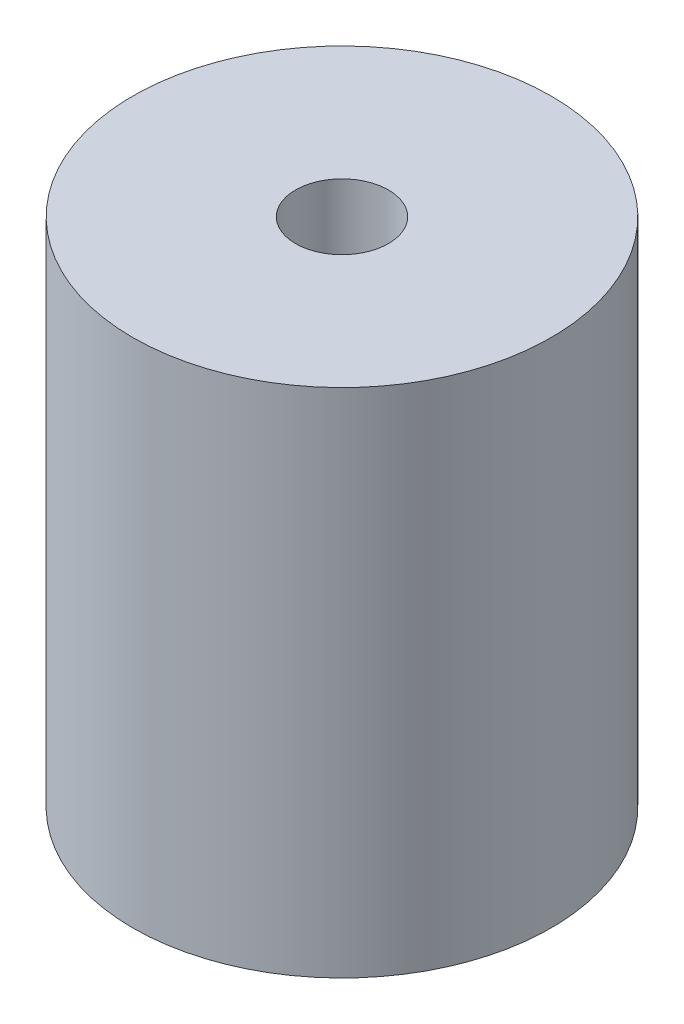
ISO-10303-21;
HEADER;
FILE_DESCRIPTION(('STEP AP214'),'2;1');
FILE_NAME('part.step','',(''),(''),'','','');
FILE_SCHEMA(('AUTOMOTIVE_DESIGN { 1 0 10303 214 1 1 1 1 }'));
ENDSEC;
DATA;
#1=APPLICATION_CONTEXT('core data for automotive mechanical design processes');
#2=APPLICATION_PROTOCOL_DEFINITION('international standard','automotive_design',2000,#1);
#3=PRODUCT_CONTEXT('',#1,'mechanical');
#4=PRODUCT('Part','Part','',(#3));
#5=PRODUCT_RELATED_PRODUCT_CATEGORY('part','',(#4));
#6=PRODUCT_DEFINITION_FORMATION('','',#4);
#7=PRODUCT_DEFINITION_CONTEXT('part definition',#1,'design');
#8=PRODUCT_DEFINITION('design','',#6,#7);
#9=PRODUCT_DEFINITION_SHAPE('','',#8);
#10=(LENGTH_UNIT() NAMED_UNIT(*) SI_UNIT(.MILLI.,.METRE.));
#11=(NAMED_UNIT(*) PLANE_ANGLE_UNIT() SI_UNIT($,.RADIAN.));
#12=(NAMED_UNIT(*) SI_UNIT($,.STERADIAN.) SOLID_ANGLE_UNIT());
#13=UNCERTAINTY_MEASURE_WITH_UNIT(LENGTH_MEASURE(1.E-05),#10,'distance_accuracy_value','');
#14=(GEOMETRIC_REPRESENTATION_CONTEXT(3) GLOBAL_UNCERTAINTY_ASSIGNED_CONTEXT((#13)) GLOBAL_UNIT_ASSIGNED_CONTEXT((#10,
#11,#12)) REPRESENTATION_CONTEXT('',''));
#15=CARTESIAN_POINT('',(0.,0.,0.));
#16=DIRECTION('',(0.,0.,1.));
#17=DIRECTION('',(1.,0.,0.));
#18=AXIS2_PLACEMENT_3D('',#15,#16,#17);
#19=CARTESIAN_POINT('',(0.,55.,0.));
#20=DIRECTION('',(0.,-1.,0.));
#21=DIRECTION('',(0.,0.,-1.));
#22=AXIS2_PLACEMENT_3D('',#19,#20,#21);
#23=CYLINDRICAL_SURFACE('',#22,22.5);
#24=CARTESIAN_POINT('',(0.,55.,0.));
#25=DIRECTION('',(0.,1.,0.));
#26=DIRECTION('',(0.,0.,1.));
#27=AXIS2_PLACEMENT_3D('',#24,#25,#26);
#28=CIRCLE('',#27,22.5);
#29=CARTESIAN_POINT('',(0.,55.,22.5));
#30=VERTEX_POINT('',#29);
#31=EDGE_CURVE('E10',#30,#30,#28,.T.);
#32=ORIENTED_EDGE('',*,*,#31,.F.);
#33=EDGE_LOOP('',(#32));
#34=FACE_BOUND('',#33,.T.);
#35=CARTESIAN_POINT('',(0.,0.,0.));
#36=DIRECTION('',(0.,1.,0.));
#37=DIRECTION('',(0.,0.,1.));
#38=AXIS2_PLACEMENT_3D('',#35,#36,#37);
#39=CIRCLE('',#38,22.5);
#40=CARTESIAN_POINT('',(0.,0.,22.5));
#41=VERTEX_POINT('',#40);
#42=EDGE_CURVE('E38',#41,#41,#39,.T.);
#43=ORIENTED_EDGE('',*,*,#42,.T.);
#44=EDGE_LOOP('',(#43));
#45=FACE_BOUND('',#44,.T.);
#46=ADVANCED_FACE('F35',(#34,#45),#23,.T.);
#47=CARTESIAN_POINT('',(0.,55.,0.));
#48=DIRECTION('',(0.,1.,0.));
#49=DIRECTION('',(0.,0.,1.));
#50=AXIS2_PLACEMENT_3D('',#47,#48,#49);
#51=PLANE('',#50);
#52=CARTESIAN_POINT('',(0.,55.,0.));
#53=DIRECTION('',(0.,1.,0.));
#54=DIRECTION('',(0.,0.,1.));
#55=AXIS2_PLACEMENT_3D('',#52,#53,#54);
#56=CIRCLE('',#55,5.);
#57=CARTESIAN_POINT('',(0.,55.,5.));
#58=VERTEX_POINT('',#57);
#59=EDGE_CURVE('E47',#58,#58,#56,.T.);
#60=ORIENTED_EDGE('',*,*,#59,.F.);
#61=EDGE_LOOP('',(#60));
#62=FACE_BOUND('',#61,.T.);
#63=ORIENTED_EDGE('',*,*,#31,.T.);
#64=EDGE_LOOP('',(#63));
#65=FACE_BOUND('',#64,.T.);
#66=ADVANCED_FACE('F72',(#62,#65),#51,.T.);
#67=CARTESIAN_POINT('',(0.,0.,0.));
#68=DIRECTION('',(0.,1.,0.));
#69=DIRECTION('',(0.,0.,1.));
#70=AXIS2_PLACEMENT_3D('',#67,#68,#69);
#71=PLANE('',#70);
#72=CARTESIAN_POINT('',(0.,0.,0.));
#73=DIRECTION('',(0.,-1.,0.));
#74=DIRECTION('',(0.,0.,-1.));
#75=AXIS2_PLACEMENT_3D('',#72,#73,#74);
#76=CIRCLE('',#75,5.);
#77=CARTESIAN_POINT('',(0.,0.,-5.));
#78=VERTEX_POINT('',#77);
#79=EDGE_CURVE('E53',#78,#78,#76,.T.);
#80=ORIENTED_EDGE('',*,*,#79,.F.);
#81=EDGE_LOOP('',(#80));
#82=FACE_BOUND('',#81,.T.);
#83=ORIENTED_EDGE('',*,*,#42,.F.);
#84=EDGE_LOOP('',(#83));
#85=FACE_BOUND('',#84,.T.);
#86=ADVANCED_FACE('F68',(#82,#85),#71,.F.);
#87=CARTESIAN_POINT('',(0.,45.,0.));
#88=DIRECTION('',(0.,1.,0.));
#89=DIRECTION('',(0.,0.,1.));
#90=AXIS2_PLACEMENT_3D('',#87,#88,#89);
#91=CYLINDRICAL_SURFACE('',#90,5.);
#92=CARTESIAN_POINT('',(0.,45.,0.));
#93=DIRECTION('',(0.,1.,0.));
#94=DIRECTION('',(0.,0.,1.));
#95=AXIS2_PLACEMENT_3D('',#92,#93,#94);
#96=CIRCLE('',#95,5.);
#97=CARTESIAN_POINT('',(0.,45.,5.));
#98=VERTEX_POINT('',#97);
#99=EDGE_CURVE('E45',#98,#98,#96,.T.);
#100=ORIENTED_EDGE('',*,*,#99,.F.);
#101=EDGE_LOOP('',(#100));
#102=FACE_BOUND('',#101,.T.);
#103=ORIENTED_EDGE('',*,*,#59,.T.);
#104=EDGE_LOOP('',(#103));
#105=FACE_BOUND('',#104,.T.);
#106=ADVANCED_FACE('F71',(#102,#105),#91,.F.);
#107=CARTESIAN_POINT('',(0.,45.,0.));
#108=DIRECTION('',(0.,1.,0.));
#109=DIRECTION('',(0.,0.,1.));
#110=AXIS2_PLACEMENT_3D('',#107,#108,#109);
#111=PLANE('',#110);
#112=ORIENTED_EDGE('',*,*,#99,.T.);
#113=EDGE_LOOP('',(#112));
#114=FACE_BOUND('',#113,.T.);
#115=ADVANCED_FACE('F64',(#114),#111,.T.);
#116=CARTESIAN_POINT('',(0.,10.,0.));
#117=DIRECTION('',(0.,-1.,0.));
#118=DIRECTION('',(0.,0.,-1.));
#119=AXIS2_PLACEMENT_3D('',#116,#117,#118);
#120=CYLINDRICAL_SURFACE('',#119,5.);
#121=CARTESIAN_POINT('',(0.,10.,0.));
#122=DIRECTION('',(0.,-1.,0.));
#123=DIRECTION('',(0.,0.,-1.));
#124=AXIS2_PLACEMENT_3D('',#121,#122,#123);
#125=CIRCLE('',#124,5.);
#126=CARTESIAN_POINT('',(0.,10.,-5.));
#127=VERTEX_POINT('',#126);
#128=EDGE_CURVE('E50',#127,#127,#125,.T.);
#129=ORIENTED_EDGE('',*,*,#128,.F.);
#130=EDGE_LOOP('',(#129));
#131=FACE_BOUND('',#130,.T.);
#132=ORIENTED_EDGE('',*,*,#79,.T.);
#133=EDGE_LOOP('',(#132));
#134=FACE_BOUND('',#133,.T.);
#135=ADVANCED_FACE('F61',(#131,#134),#120,.F.);
#136=CARTESIAN_POINT('',(0.,10.,0.));
#137=DIRECTION('',(0.,-1.,0.));
#138=DIRECTION('',(0.,0.,-1.));
#139=AXIS2_PLACEMENT_3D('',#136,#137,#138);
#140=PLANE('',#139);
#141=ORIENTED_EDGE('',*,*,#128,.T.);
#142=EDGE_LOOP('',(#141));
#143=FACE_BOUND('',#142,.T.);
#144=ADVANCED_FACE('F59',(#143),#140,.T.);
#145=CLOSED_SHELL('',(#46,#66,#86,#106,#115,#135,#144));
#146=MANIFOLD_SOLID_BREP('B2',#145);
#147=ADVANCED_BREP_SHAPE_REPRESENTATION('',(#18,#146),#14);
#148=SHAPE_DEFINITION_REPRESENTATION(#9,#147);
ENDSEC;
END-ISO-10303-21;
